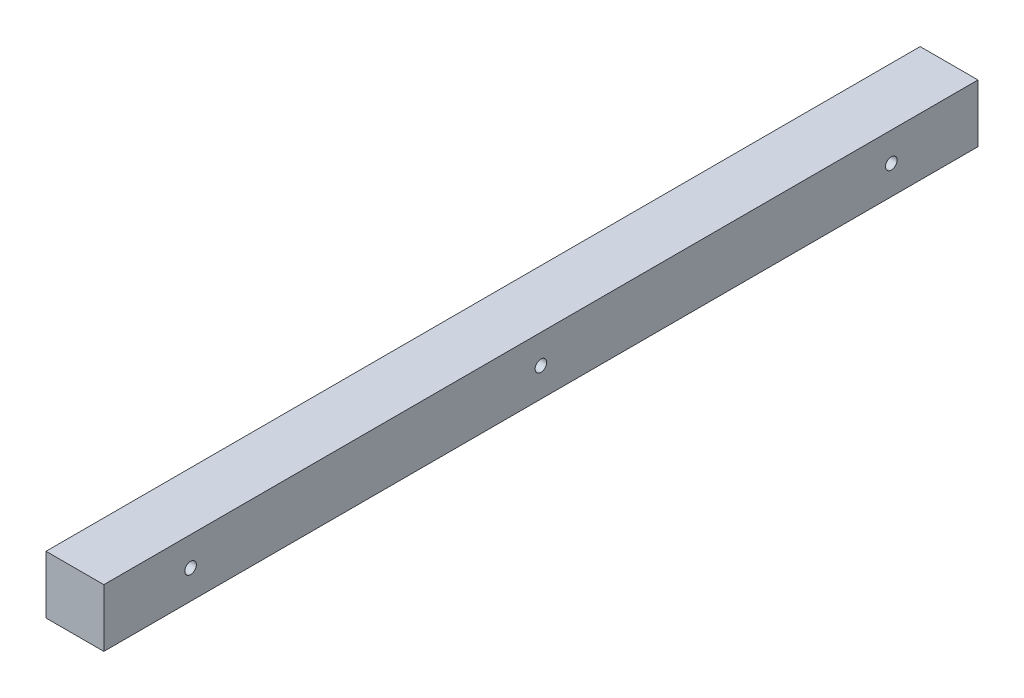
ISO-10303-21;
HEADER;
FILE_DESCRIPTION(('STEP AP214'),'2;1');
FILE_NAME('part.step','',(''),(''),'','','');
FILE_SCHEMA(('AUTOMOTIVE_DESIGN { 1 0 10303 214 1 1 1 1 }'));
ENDSEC;
DATA;
#1=APPLICATION_CONTEXT('core data for automotive mechanical design processes');
#2=APPLICATION_PROTOCOL_DEFINITION('international standard','automotive_design',2000,#1);
#3=PRODUCT_CONTEXT('',#1,'mechanical');
#4=PRODUCT('Part','Part','',(#3));
#5=PRODUCT_RELATED_PRODUCT_CATEGORY('part','',(#4));
#6=PRODUCT_DEFINITION_FORMATION('','',#4);
#7=PRODUCT_DEFINITION_CONTEXT('part definition',#1,'design');
#8=PRODUCT_DEFINITION('design','',#6,#7);
#9=PRODUCT_DEFINITION_SHAPE('','',#8);
#10=(LENGTH_UNIT() NAMED_UNIT(*) SI_UNIT(.MILLI.,.METRE.));
#11=(NAMED_UNIT(*) PLANE_ANGLE_UNIT() SI_UNIT($,.RADIAN.));
#12=(NAMED_UNIT(*) SI_UNIT($,.STERADIAN.) SOLID_ANGLE_UNIT());
#13=UNCERTAINTY_MEASURE_WITH_UNIT(LENGTH_MEASURE(1.E-05),#10,'distance_accuracy_value','');
#14=(GEOMETRIC_REPRESENTATION_CONTEXT(3) GLOBAL_UNCERTAINTY_ASSIGNED_CONTEXT((#13)) GLOBAL_UNIT_ASSIGNED_CONTEXT((#10,
#11,#12)) REPRESENTATION_CONTEXT('',''));
#15=CARTESIAN_POINT('',(0.,0.,0.));
#16=DIRECTION('',(0.,0.,1.));
#17=DIRECTION('',(1.,0.,0.));
#18=AXIS2_PLACEMENT_3D('',#15,#16,#17);
#19=CARTESIAN_POINT('',(0.,0.,302.33));
#20=DIRECTION('',(1.,0.,0.));
#21=DIRECTION('',(0.,0.,-1.));
#22=AXIS2_PLACEMENT_3D('',#19,#20,#21);
#23=PLANE('',#22);
#24=CARTESIAN_POINT('',(0.,10.,30.));
#25=DIRECTION('',(-1.,0.,0.));
#26=DIRECTION('',(0.,0.,1.));
#27=AXIS2_PLACEMENT_3D('',#24,#25,#26);
#28=CIRCLE('',#27,2.);
#29=CARTESIAN_POINT('',(0.,10.,32.));
#30=VERTEX_POINT('',#29);
#31=EDGE_CURVE('E127',#30,#30,#28,.T.);
#32=ORIENTED_EDGE('',*,*,#31,.F.);
#33=EDGE_LOOP('',(#32));
#34=FACE_BOUND('',#33,.T.);
#35=CARTESIAN_POINT('',(0.,10.,272.33));
#36=DIRECTION('',(-1.,0.,0.));
#37=DIRECTION('',(0.,0.,1.));
#38=AXIS2_PLACEMENT_3D('',#35,#36,#37);
#39=CIRCLE('',#38,2.);
#40=CARTESIAN_POINT('',(0.,10.,274.33));
#41=VERTEX_POINT('',#40);
#42=EDGE_CURVE('E121',#41,#41,#39,.T.);
#43=ORIENTED_EDGE('',*,*,#42,.F.);
#44=EDGE_LOOP('',(#43));
#45=FACE_BOUND('',#44,.T.);
#46=CARTESIAN_POINT('',(0.,10.,151.165));
#47=DIRECTION('',(-1.,0.,0.));
#48=DIRECTION('',(0.,0.,1.));
#49=AXIS2_PLACEMENT_3D('',#46,#47,#48);
#50=CIRCLE('',#49,2.);
#51=CARTESIAN_POINT('',(0.,10.,153.165));
#52=VERTEX_POINT('',#51);
#53=EDGE_CURVE('E115',#52,#52,#50,.T.);
#54=ORIENTED_EDGE('',*,*,#53,.F.);
#55=EDGE_LOOP('',(#54));
#56=FACE_BOUND('',#55,.T.);
#57=DIRECTION('',(0.,-1.,0.));
#58=VECTOR('',#57,1.);
#59=CARTESIAN_POINT('',(0.,0.,0.));
#60=LINE('',#59,#58);
#61=CARTESIAN_POINT('',(0.,20.,0.));
#62=VERTEX_POINT('',#61);
#63=CARTESIAN_POINT('',(0.,0.,0.));
#64=VERTEX_POINT('',#63);
#65=EDGE_CURVE('E101',#62,#64,#60,.T.);
#66=ORIENTED_EDGE('',*,*,#65,.T.);
#67=DIRECTION('',(0.,0.,-1.));
#68=VECTOR('',#67,1.);
#69=CARTESIAN_POINT('',(0.,0.,302.33));
#70=LINE('',#69,#68);
#71=CARTESIAN_POINT('',(0.,0.,302.33));
#72=VERTEX_POINT('',#71);
#73=EDGE_CURVE('E11',#72,#64,#70,.T.);
#74=ORIENTED_EDGE('',*,*,#73,.F.);
#75=DIRECTION('',(0.,-1.,0.));
#76=VECTOR('',#75,1.);
#77=CARTESIAN_POINT('',(0.,0.,302.33));
#78=LINE('',#77,#76);
#79=CARTESIAN_POINT('',(0.,20.,302.33));
#80=VERTEX_POINT('',#79);
#81=EDGE_CURVE('E89',#80,#72,#78,.T.);
#82=ORIENTED_EDGE('',*,*,#81,.F.);
#83=DIRECTION('',(0.,0.,-1.));
#84=VECTOR('',#83,1.);
#85=CARTESIAN_POINT('',(0.,20.,302.33));
#86=LINE('',#85,#84);
#87=EDGE_CURVE('E97',#80,#62,#86,.T.);
#88=ORIENTED_EDGE('',*,*,#87,.T.);
#89=EDGE_LOOP('',(#66,#74,#82,#88));
#90=FACE_BOUND('',#89,.T.);
#91=ADVANCED_FACE('F38',(#34,#45,#56,#90),#23,.F.);
#92=CARTESIAN_POINT('',(0.,0.,302.33));
#93=DIRECTION('',(0.,1.,0.));
#94=DIRECTION('',(0.,0.,1.));
#95=AXIS2_PLACEMENT_3D('',#92,#93,#94);
#96=PLANE('',#95);
#97=DIRECTION('',(1.,0.,0.));
#98=VECTOR('',#97,1.);
#99=CARTESIAN_POINT('',(0.,0.,0.));
#100=LINE('',#99,#98);
#101=CARTESIAN_POINT('',(20.,0.,0.));
#102=VERTEX_POINT('',#101);
#103=EDGE_CURVE('E93',#64,#102,#100,.T.);
#104=ORIENTED_EDGE('',*,*,#103,.T.);
#105=DIRECTION('',(0.,0.,-1.));
#106=VECTOR('',#105,1.);
#107=CARTESIAN_POINT('',(20.,0.,302.33));
#108=LINE('',#107,#106);
#109=CARTESIAN_POINT('',(20.,0.,302.33));
#110=VERTEX_POINT('',#109);
#111=EDGE_CURVE('E46',#110,#102,#108,.T.);
#112=ORIENTED_EDGE('',*,*,#111,.F.);
#113=DIRECTION('',(1.,0.,0.));
#114=VECTOR('',#113,1.);
#115=CARTESIAN_POINT('',(0.,0.,302.33));
#116=LINE('',#115,#114);
#117=EDGE_CURVE('E84',#72,#110,#116,.T.);
#118=ORIENTED_EDGE('',*,*,#117,.F.);
#119=ORIENTED_EDGE('',*,*,#73,.T.);
#120=EDGE_LOOP('',(#104,#112,#118,#119));
#121=FACE_BOUND('',#120,.T.);
#122=ADVANCED_FACE('F92',(#121),#96,.F.);
#123=CARTESIAN_POINT('',(20.,0.,302.33));
#124=DIRECTION('',(-1.,0.,0.));
#125=DIRECTION('',(0.,0.,1.));
#126=AXIS2_PLACEMENT_3D('',#123,#124,#125);
#127=PLANE('',#126);
#128=CARTESIAN_POINT('',(20.,10.,30.));
#129=DIRECTION('',(-1.,0.,0.));
#130=DIRECTION('',(0.,0.,1.));
#131=AXIS2_PLACEMENT_3D('',#128,#129,#130);
#132=CIRCLE('',#131,2.);
#133=CARTESIAN_POINT('',(20.,10.,32.));
#134=VERTEX_POINT('',#133);
#135=EDGE_CURVE('E104',#134,#134,#132,.T.);
#136=ORIENTED_EDGE('',*,*,#135,.T.);
#137=EDGE_LOOP('',(#136));
#138=FACE_BOUND('',#137,.T.);
#139=CARTESIAN_POINT('',(20.,10.,272.33));
#140=DIRECTION('',(-1.,0.,0.));
#141=DIRECTION('',(0.,0.,1.));
#142=AXIS2_PLACEMENT_3D('',#139,#140,#141);
#143=CIRCLE('',#142,2.);
#144=CARTESIAN_POINT('',(20.,10.,274.33));
#145=VERTEX_POINT('',#144);
#146=EDGE_CURVE('E124',#145,#145,#143,.T.);
#147=ORIENTED_EDGE('',*,*,#146,.T.);
#148=EDGE_LOOP('',(#147));
#149=FACE_BOUND('',#148,.T.);
#150=CARTESIAN_POINT('',(20.,10.,151.165));
#151=DIRECTION('',(-1.,0.,0.));
#152=DIRECTION('',(0.,0.,1.));
#153=AXIS2_PLACEMENT_3D('',#150,#151,#152);
#154=CIRCLE('',#153,2.);
#155=CARTESIAN_POINT('',(20.,10.,153.165));
#156=VERTEX_POINT('',#155);
#157=EDGE_CURVE('E118',#156,#156,#154,.T.);
#158=ORIENTED_EDGE('',*,*,#157,.T.);
#159=EDGE_LOOP('',(#158));
#160=FACE_BOUND('',#159,.T.);
#161=DIRECTION('',(0.,1.,0.));
#162=VECTOR('',#161,1.);
#163=CARTESIAN_POINT('',(20.,0.,0.));
#164=LINE('',#163,#162);
#165=CARTESIAN_POINT('',(20.,20.,0.));
#166=VERTEX_POINT('',#165);
#167=EDGE_CURVE('E71',#102,#166,#164,.T.);
#168=ORIENTED_EDGE('',*,*,#167,.T.);
#169=DIRECTION('',(0.,0.,-1.));
#170=VECTOR('',#169,1.);
#171=CARTESIAN_POINT('',(20.,20.,302.33));
#172=LINE('',#171,#170);
#173=CARTESIAN_POINT('',(20.,20.,302.33));
#174=VERTEX_POINT('',#173);
#175=EDGE_CURVE('E94',#174,#166,#172,.T.);
#176=ORIENTED_EDGE('',*,*,#175,.F.);
#177=DIRECTION('',(0.,1.,0.));
#178=VECTOR('',#177,1.);
#179=CARTESIAN_POINT('',(20.,0.,302.33));
#180=LINE('',#179,#178);
#181=EDGE_CURVE('E87',#110,#174,#180,.T.);
#182=ORIENTED_EDGE('',*,*,#181,.F.);
#183=ORIENTED_EDGE('',*,*,#111,.T.);
#184=EDGE_LOOP('',(#168,#176,#182,#183));
#185=FACE_BOUND('',#184,.T.);
#186=ADVANCED_FACE('F95',(#138,#149,#160,#185),#127,.F.);
#187=CARTESIAN_POINT('',(0.,20.,302.33));
#188=DIRECTION('',(0.,-1.,0.));
#189=DIRECTION('',(0.,0.,-1.));
#190=AXIS2_PLACEMENT_3D('',#187,#188,#189);
#191=PLANE('',#190);
#192=DIRECTION('',(-1.,0.,0.));
#193=VECTOR('',#192,1.);
#194=CARTESIAN_POINT('',(0.,20.,0.));
#195=LINE('',#194,#193);
#196=EDGE_CURVE('E77',#166,#62,#195,.T.);
#197=ORIENTED_EDGE('',*,*,#196,.T.);
#198=ORIENTED_EDGE('',*,*,#87,.F.);
#199=DIRECTION('',(-1.,0.,0.));
#200=VECTOR('',#199,1.);
#201=CARTESIAN_POINT('',(0.,20.,302.33));
#202=LINE('',#201,#200);
#203=EDGE_CURVE('E54',#174,#80,#202,.T.);
#204=ORIENTED_EDGE('',*,*,#203,.F.);
#205=ORIENTED_EDGE('',*,*,#175,.T.);
#206=EDGE_LOOP('',(#197,#198,#204,#205));
#207=FACE_BOUND('',#206,.T.);
#208=ADVANCED_FACE('F109',(#207),#191,.F.);
#209=CARTESIAN_POINT('',(0.,0.,302.33));
#210=DIRECTION('',(0.,0.,-1.));
#211=DIRECTION('',(-1.,0.,0.));
#212=AXIS2_PLACEMENT_3D('',#209,#210,#211);
#213=PLANE('',#212);
#214=ORIENTED_EDGE('',*,*,#81,.T.);
#215=ORIENTED_EDGE('',*,*,#117,.T.);
#216=ORIENTED_EDGE('',*,*,#181,.T.);
#217=ORIENTED_EDGE('',*,*,#203,.T.);
#218=EDGE_LOOP('',(#214,#215,#216,#217));
#219=FACE_BOUND('',#218,.T.);
#220=ADVANCED_FACE('F85',(#219),#213,.F.);
#221=CARTESIAN_POINT('',(0.,0.,0.));
#222=DIRECTION('',(0.,0.,-1.));
#223=DIRECTION('',(-1.,0.,0.));
#224=AXIS2_PLACEMENT_3D('',#221,#222,#223);
#225=PLANE('',#224);
#226=ORIENTED_EDGE('',*,*,#65,.F.);
#227=ORIENTED_EDGE('',*,*,#196,.F.);
#228=ORIENTED_EDGE('',*,*,#167,.F.);
#229=ORIENTED_EDGE('',*,*,#103,.F.);
#230=EDGE_LOOP('',(#226,#227,#228,#229));
#231=FACE_BOUND('',#230,.T.);
#232=ADVANCED_FACE('F112',(#231),#225,.T.);
#233=CARTESIAN_POINT('',(20.,10.,151.165));
#234=DIRECTION('',(-1.,0.,0.));
#235=DIRECTION('',(0.,0.,1.));
#236=AXIS2_PLACEMENT_3D('',#233,#234,#235);
#237=CYLINDRICAL_SURFACE('',#236,2.);
#238=ORIENTED_EDGE('',*,*,#157,.F.);
#239=EDGE_LOOP('',(#238));
#240=FACE_BOUND('',#239,.T.);
#241=ORIENTED_EDGE('',*,*,#53,.T.);
#242=EDGE_LOOP('',(#241));
#243=FACE_BOUND('',#242,.T.);
#244=ADVANCED_FACE('F148',(#240,#243),#237,.F.);
#245=CARTESIAN_POINT('',(20.,10.,272.33));
#246=DIRECTION('',(-1.,0.,0.));
#247=DIRECTION('',(0.,0.,1.));
#248=AXIS2_PLACEMENT_3D('',#245,#246,#247);
#249=CYLINDRICAL_SURFACE('',#248,2.);
#250=ORIENTED_EDGE('',*,*,#146,.F.);
#251=EDGE_LOOP('',(#250));
#252=FACE_BOUND('',#251,.T.);
#253=ORIENTED_EDGE('',*,*,#42,.T.);
#254=EDGE_LOOP('',(#253));
#255=FACE_BOUND('',#254,.T.);
#256=ADVANCED_FACE('F138',(#252,#255),#249,.F.);
#257=CARTESIAN_POINT('',(20.,10.,30.));
#258=DIRECTION('',(-1.,0.,0.));
#259=DIRECTION('',(0.,0.,1.));
#260=AXIS2_PLACEMENT_3D('',#257,#258,#259);
#261=CYLINDRICAL_SURFACE('',#260,2.);
#262=ORIENTED_EDGE('',*,*,#135,.F.);
#263=EDGE_LOOP('',(#262));
#264=FACE_BOUND('',#263,.T.);
#265=ORIENTED_EDGE('',*,*,#31,.T.);
#266=EDGE_LOOP('',(#265));
#267=FACE_BOUND('',#266,.T.);
#268=ADVANCED_FACE('F135',(#264,#267),#261,.F.);
#269=CLOSED_SHELL('',(#91,#122,#186,#208,#220,#232,#244,#256,#268));
#270=MANIFOLD_SOLID_BREP('B2',#269);
#271=ADVANCED_BREP_SHAPE_REPRESENTATION('',(#18,#270),#14);
#272=SHAPE_DEFINITION_REPRESENTATION(#9,#271);
ENDSEC;
END-ISO-10303-21;
